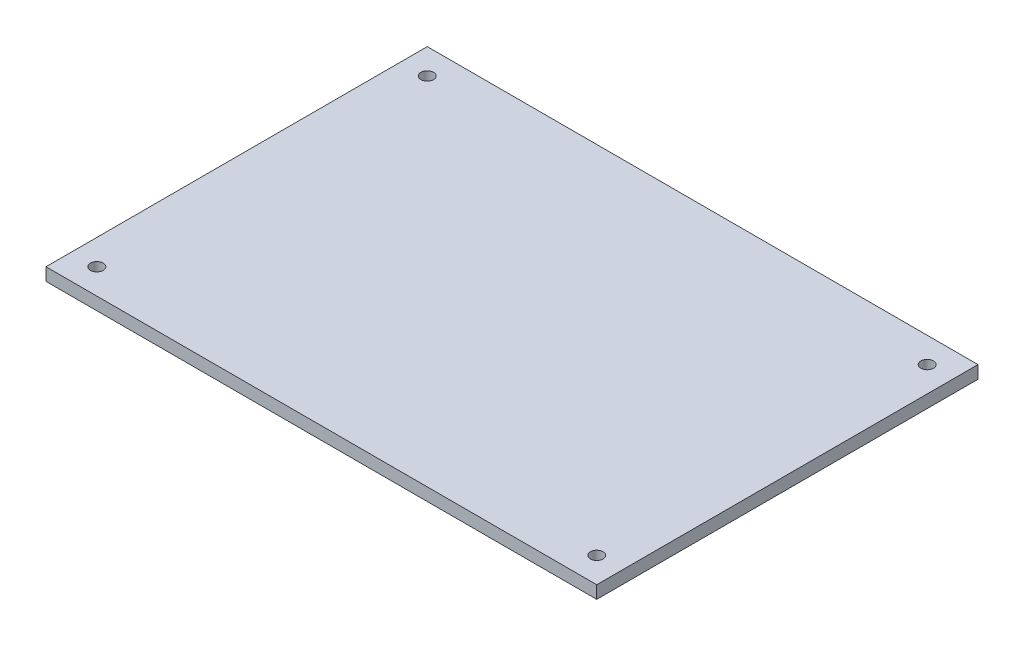
ISO-10303-21;
HEADER;
FILE_DESCRIPTION(('STEP AP214'),'2;1');
FILE_NAME('part.step','',(''),(''),'','','');
FILE_SCHEMA(('AUTOMOTIVE_DESIGN { 1 0 10303 214 1 1 1 1 }'));
ENDSEC;
DATA;
#1=APPLICATION_CONTEXT('core data for automotive mechanical design processes');
#2=APPLICATION_PROTOCOL_DEFINITION('international standard','automotive_design',2000,#1);
#3=PRODUCT_CONTEXT('',#1,'mechanical');
#4=PRODUCT('Part','Part','',(#3));
#5=PRODUCT_RELATED_PRODUCT_CATEGORY('part','',(#4));
#6=PRODUCT_DEFINITION_FORMATION('','',#4);
#7=PRODUCT_DEFINITION_CONTEXT('part definition',#1,'design');
#8=PRODUCT_DEFINITION('design','',#6,#7);
#9=PRODUCT_DEFINITION_SHAPE('','',#8);
#10=(LENGTH_UNIT() NAMED_UNIT(*) SI_UNIT(.MILLI.,.METRE.));
#11=(NAMED_UNIT(*) PLANE_ANGLE_UNIT() SI_UNIT($,.RADIAN.));
#12=(NAMED_UNIT(*) SI_UNIT($,.STERADIAN.) SOLID_ANGLE_UNIT());
#13=UNCERTAINTY_MEASURE_WITH_UNIT(LENGTH_MEASURE(1.E-05),#10,'distance_accuracy_value','');
#14=(GEOMETRIC_REPRESENTATION_CONTEXT(3) GLOBAL_UNCERTAINTY_ASSIGNED_CONTEXT((#13)) GLOBAL_UNIT_ASSIGNED_CONTEXT((#10,
#11,#12)) REPRESENTATION_CONTEXT('',''));
#15=CARTESIAN_POINT('',(0.,0.,0.));
#16=DIRECTION('',(0.,0.,1.));
#17=DIRECTION('',(1.,0.,0.));
#18=AXIS2_PLACEMENT_3D('',#15,#16,#17);
#19=CARTESIAN_POINT('',(-59.,0.,-39.));
#20=DIRECTION('',(0.,1.,0.));
#21=DIRECTION('',(0.,0.,1.));
#22=AXIS2_PLACEMENT_3D('',#19,#20,#21);
#23=CYLINDRICAL_SURFACE('',#22,1.5);
#24=CARTESIAN_POINT('',(-59.,0.,-39.));
#25=DIRECTION('',(0.,1.,0.));
#26=DIRECTION('',(0.,0.,1.));
#27=AXIS2_PLACEMENT_3D('',#24,#25,#26);
#28=CIRCLE('',#27,1.5);
#29=CARTESIAN_POINT('',(-59.,0.,-37.5));
#30=VERTEX_POINT('',#29);
#31=EDGE_CURVE('E40',#30,#30,#28,.T.);
#32=ORIENTED_EDGE('',*,*,#31,.F.);
#33=EDGE_LOOP('',(#32));
#34=FACE_BOUND('',#33,.T.);
#35=CARTESIAN_POINT('',(-59.,3.,-39.));
#36=DIRECTION('',(0.,1.,0.));
#37=DIRECTION('',(0.,0.,1.));
#38=AXIS2_PLACEMENT_3D('',#35,#36,#37);
#39=CIRCLE('',#38,1.5);
#40=CARTESIAN_POINT('',(-59.,3.,-37.5));
#41=VERTEX_POINT('',#40);
#42=EDGE_CURVE('E11',#41,#41,#39,.T.);
#43=ORIENTED_EDGE('',*,*,#42,.T.);
#44=EDGE_LOOP('',(#43));
#45=FACE_BOUND('',#44,.T.);
#46=ADVANCED_FACE('F32',(#34,#45),#23,.F.);
#47=CARTESIAN_POINT('',(-59.,0.,39.));
#48=DIRECTION('',(0.,1.,0.));
#49=DIRECTION('',(0.,0.,1.));
#50=AXIS2_PLACEMENT_3D('',#47,#48,#49);
#51=CYLINDRICAL_SURFACE('',#50,1.5);
#52=CARTESIAN_POINT('',(-59.,0.,39.));
#53=DIRECTION('',(0.,1.,0.));
#54=DIRECTION('',(0.,0.,1.));
#55=AXIS2_PLACEMENT_3D('',#52,#53,#54);
#56=CIRCLE('',#55,1.5);
#57=CARTESIAN_POINT('',(-59.,0.,40.5));
#58=VERTEX_POINT('',#57);
#59=EDGE_CURVE('E110',#58,#58,#56,.T.);
#60=ORIENTED_EDGE('',*,*,#59,.F.);
#61=EDGE_LOOP('',(#60));
#62=FACE_BOUND('',#61,.T.);
#63=CARTESIAN_POINT('',(-59.,3.,39.));
#64=DIRECTION('',(0.,1.,0.));
#65=DIRECTION('',(0.,0.,1.));
#66=AXIS2_PLACEMENT_3D('',#63,#64,#65);
#67=CIRCLE('',#66,1.5);
#68=CARTESIAN_POINT('',(-59.,3.,40.5));
#69=VERTEX_POINT('',#68);
#70=EDGE_CURVE('E113',#69,#69,#67,.T.);
#71=ORIENTED_EDGE('',*,*,#70,.T.);
#72=EDGE_LOOP('',(#71));
#73=FACE_BOUND('',#72,.T.);
#74=ADVANCED_FACE('F122',(#62,#73),#51,.F.);
#75=CARTESIAN_POINT('',(-65.,3.,45.));
#76=DIRECTION('',(1.,0.,0.));
#77=DIRECTION('',(0.,0.,-1.));
#78=AXIS2_PLACEMENT_3D('',#75,#76,#77);
#79=PLANE('',#78);
#80=DIRECTION('',(0.,0.,1.));
#81=VECTOR('',#80,1.);
#82=CARTESIAN_POINT('',(-65.,0.,45.));
#83=LINE('',#82,#81);
#84=CARTESIAN_POINT('',(-65.,0.,-45.));
#85=VERTEX_POINT('',#84);
#86=CARTESIAN_POINT('',(-65.,0.,45.));
#87=VERTEX_POINT('',#86);
#88=EDGE_CURVE('E100',#85,#87,#83,.T.);
#89=ORIENTED_EDGE('',*,*,#88,.T.);
#90=DIRECTION('',(0.,-1.,0.));
#91=VECTOR('',#90,1.);
#92=CARTESIAN_POINT('',(-65.,3.,45.));
#93=LINE('',#92,#91);
#94=CARTESIAN_POINT('',(-65.,3.,45.));
#95=VERTEX_POINT('',#94);
#96=EDGE_CURVE('E91',#95,#87,#93,.T.);
#97=ORIENTED_EDGE('',*,*,#96,.F.);
#98=DIRECTION('',(0.,0.,1.));
#99=VECTOR('',#98,1.);
#100=CARTESIAN_POINT('',(-65.,3.,45.));
#101=LINE('',#100,#99);
#102=CARTESIAN_POINT('',(-65.,3.,-45.));
#103=VERTEX_POINT('',#102);
#104=EDGE_CURVE('E85',#103,#95,#101,.T.);
#105=ORIENTED_EDGE('',*,*,#104,.F.);
#106=DIRECTION('',(0.,-1.,0.));
#107=VECTOR('',#106,1.);
#108=CARTESIAN_POINT('',(-65.,3.,-45.));
#109=LINE('',#108,#107);
#110=EDGE_CURVE('E96',#103,#85,#109,.T.);
#111=ORIENTED_EDGE('',*,*,#110,.T.);
#112=EDGE_LOOP('',(#89,#97,#105,#111));
#113=FACE_BOUND('',#112,.T.);
#114=ADVANCED_FACE('F146',(#113),#79,.F.);
#115=CARTESIAN_POINT('',(65.,3.,45.));
#116=DIRECTION('',(0.,0.,-1.));
#117=DIRECTION('',(-1.,0.,0.));
#118=AXIS2_PLACEMENT_3D('',#115,#116,#117);
#119=PLANE('',#118);
#120=DIRECTION('',(1.,0.,0.));
#121=VECTOR('',#120,1.);
#122=CARTESIAN_POINT('',(65.,0.,45.));
#123=LINE('',#122,#121);
#124=CARTESIAN_POINT('',(65.,0.,45.));
#125=VERTEX_POINT('',#124);
#126=EDGE_CURVE('E90',#87,#125,#123,.T.);
#127=ORIENTED_EDGE('',*,*,#126,.T.);
#128=DIRECTION('',(0.,-1.,0.));
#129=VECTOR('',#128,1.);
#130=CARTESIAN_POINT('',(65.,3.,45.));
#131=LINE('',#130,#129);
#132=CARTESIAN_POINT('',(65.,3.,45.));
#133=VERTEX_POINT('',#132);
#134=EDGE_CURVE('E88',#133,#125,#131,.T.);
#135=ORIENTED_EDGE('',*,*,#134,.F.);
#136=DIRECTION('',(1.,0.,0.));
#137=VECTOR('',#136,1.);
#138=CARTESIAN_POINT('',(65.,3.,45.));
#139=LINE('',#138,#137);
#140=EDGE_CURVE('E79',#95,#133,#139,.T.);
#141=ORIENTED_EDGE('',*,*,#140,.F.);
#142=ORIENTED_EDGE('',*,*,#96,.T.);
#143=EDGE_LOOP('',(#127,#135,#141,#142));
#144=FACE_BOUND('',#143,.T.);
#145=ADVANCED_FACE('F89',(#144),#119,.F.);
#146=CARTESIAN_POINT('',(65.,3.,45.));
#147=DIRECTION('',(-1.,0.,0.));
#148=DIRECTION('',(0.,0.,1.));
#149=AXIS2_PLACEMENT_3D('',#146,#147,#148);
#150=PLANE('',#149);
#151=DIRECTION('',(0.,0.,-1.));
#152=VECTOR('',#151,1.);
#153=CARTESIAN_POINT('',(65.,0.,45.));
#154=LINE('',#153,#152);
#155=CARTESIAN_POINT('',(65.,0.,-45.));
#156=VERTEX_POINT('',#155);
#157=EDGE_CURVE('E65',#125,#156,#154,.T.);
#158=ORIENTED_EDGE('',*,*,#157,.T.);
#159=DIRECTION('',(0.,-1.,0.));
#160=VECTOR('',#159,1.);
#161=CARTESIAN_POINT('',(65.,3.,-45.));
#162=LINE('',#161,#160);
#163=CARTESIAN_POINT('',(65.,3.,-45.));
#164=VERTEX_POINT('',#163);
#165=EDGE_CURVE('E92',#164,#156,#162,.T.);
#166=ORIENTED_EDGE('',*,*,#165,.F.);
#167=DIRECTION('',(0.,0.,-1.));
#168=VECTOR('',#167,1.);
#169=CARTESIAN_POINT('',(65.,3.,45.));
#170=LINE('',#169,#168);
#171=EDGE_CURVE('E83',#133,#164,#170,.T.);
#172=ORIENTED_EDGE('',*,*,#171,.F.);
#173=ORIENTED_EDGE('',*,*,#134,.T.);
#174=EDGE_LOOP('',(#158,#166,#172,#173));
#175=FACE_BOUND('',#174,.T.);
#176=ADVANCED_FACE('F94',(#175),#150,.F.);
#177=CARTESIAN_POINT('',(65.,3.,-45.));
#178=DIRECTION('',(0.,0.,1.));
#179=DIRECTION('',(1.,0.,0.));
#180=AXIS2_PLACEMENT_3D('',#177,#178,#179);
#181=PLANE('',#180);
#182=DIRECTION('',(-1.,0.,0.));
#183=VECTOR('',#182,1.);
#184=CARTESIAN_POINT('',(65.,0.,-45.));
#185=LINE('',#184,#183);
#186=EDGE_CURVE('E71',#156,#85,#185,.T.);
#187=ORIENTED_EDGE('',*,*,#186,.T.);
#188=ORIENTED_EDGE('',*,*,#110,.F.);
#189=DIRECTION('',(-1.,0.,0.));
#190=VECTOR('',#189,1.);
#191=CARTESIAN_POINT('',(65.,3.,-45.));
#192=LINE('',#191,#190);
#193=EDGE_CURVE('E48',#164,#103,#192,.T.);
#194=ORIENTED_EDGE('',*,*,#193,.F.);
#195=ORIENTED_EDGE('',*,*,#165,.T.);
#196=EDGE_LOOP('',(#187,#188,#194,#195));
#197=FACE_BOUND('',#196,.T.);
#198=ADVANCED_FACE('F126',(#197),#181,.F.);
#199=CARTESIAN_POINT('',(0.,3.,0.));
#200=DIRECTION('',(0.,1.,0.));
#201=DIRECTION('',(0.,0.,1.));
#202=AXIS2_PLACEMENT_3D('',#199,#200,#201);
#203=PLANE('',#202);
#204=CARTESIAN_POINT('',(59.,3.,-39.));
#205=DIRECTION('',(0.,1.,0.));
#206=DIRECTION('',(0.,0.,1.));
#207=AXIS2_PLACEMENT_3D('',#204,#205,#206);
#208=CIRCLE('',#207,1.5);
#209=CARTESIAN_POINT('',(59.,3.,-37.5));
#210=VERTEX_POINT('',#209);
#211=EDGE_CURVE('E217',#210,#210,#208,.T.);
#212=ORIENTED_EDGE('',*,*,#211,.F.);
#213=EDGE_LOOP('',(#212));
#214=FACE_BOUND('',#213,.T.);
#215=CARTESIAN_POINT('',(59.,3.,39.));
#216=DIRECTION('',(0.,1.,0.));
#217=DIRECTION('',(0.,0.,1.));
#218=AXIS2_PLACEMENT_3D('',#215,#216,#217);
#219=CIRCLE('',#218,1.5);
#220=CARTESIAN_POINT('',(59.,3.,40.5));
#221=VERTEX_POINT('',#220);
#222=EDGE_CURVE('E218',#221,#221,#219,.T.);
#223=ORIENTED_EDGE('',*,*,#222,.F.);
#224=EDGE_LOOP('',(#223));
#225=FACE_BOUND('',#224,.T.);
#226=ORIENTED_EDGE('',*,*,#104,.T.);
#227=ORIENTED_EDGE('',*,*,#140,.T.);
#228=ORIENTED_EDGE('',*,*,#171,.T.);
#229=ORIENTED_EDGE('',*,*,#193,.T.);
#230=EDGE_LOOP('',(#226,#227,#228,#229));
#231=FACE_BOUND('',#230,.T.);
#232=ORIENTED_EDGE('',*,*,#70,.F.);
#233=EDGE_LOOP('',(#232));
#234=FACE_BOUND('',#233,.T.);
#235=ORIENTED_EDGE('',*,*,#42,.F.);
#236=EDGE_LOOP('',(#235));
#237=FACE_BOUND('',#236,.T.);
#238=ADVANCED_FACE('F80',(#214,#225,#231,#234,#237),#203,.T.);
#239=CARTESIAN_POINT('',(0.,0.,0.));
#240=DIRECTION('',(0.,1.,0.));
#241=DIRECTION('',(0.,0.,1.));
#242=AXIS2_PLACEMENT_3D('',#239,#240,#241);
#243=PLANE('',#242);
#244=CARTESIAN_POINT('',(59.,0.,-39.));
#245=DIRECTION('',(0.,1.,0.));
#246=DIRECTION('',(0.,0.,1.));
#247=AXIS2_PLACEMENT_3D('',#244,#245,#246);
#248=CIRCLE('',#247,1.5);
#249=CARTESIAN_POINT('',(59.,0.,-37.5));
#250=VERTEX_POINT('',#249);
#251=EDGE_CURVE('E215',#250,#250,#248,.T.);
#252=ORIENTED_EDGE('',*,*,#251,.T.);
#253=EDGE_LOOP('',(#252));
#254=FACE_BOUND('',#253,.T.);
#255=CARTESIAN_POINT('',(59.,0.,39.));
#256=DIRECTION('',(0.,1.,0.));
#257=DIRECTION('',(0.,0.,1.));
#258=AXIS2_PLACEMENT_3D('',#255,#256,#257);
#259=CIRCLE('',#258,1.5);
#260=CARTESIAN_POINT('',(59.,0.,40.5));
#261=VERTEX_POINT('',#260);
#262=EDGE_CURVE('E103',#261,#261,#259,.T.);
#263=ORIENTED_EDGE('',*,*,#262,.T.);
#264=EDGE_LOOP('',(#263));
#265=FACE_BOUND('',#264,.T.);
#266=ORIENTED_EDGE('',*,*,#88,.F.);
#267=ORIENTED_EDGE('',*,*,#186,.F.);
#268=ORIENTED_EDGE('',*,*,#157,.F.);
#269=ORIENTED_EDGE('',*,*,#126,.F.);
#270=EDGE_LOOP('',(#266,#267,#268,#269));
#271=FACE_BOUND('',#270,.T.);
#272=ORIENTED_EDGE('',*,*,#59,.T.);
#273=EDGE_LOOP('',(#272));
#274=FACE_BOUND('',#273,.T.);
#275=ORIENTED_EDGE('',*,*,#31,.T.);
#276=EDGE_LOOP('',(#275));
#277=FACE_BOUND('',#276,.T.);
#278=ADVANCED_FACE('F118',(#254,#265,#271,#274,#277),#243,.F.);
#279=CARTESIAN_POINT('',(59.,0.,39.));
#280=DIRECTION('',(0.,1.,0.));
#281=DIRECTION('',(0.,0.,1.));
#282=AXIS2_PLACEMENT_3D('',#279,#280,#281);
#283=CYLINDRICAL_SURFACE('',#282,1.5);
#284=ORIENTED_EDGE('',*,*,#262,.F.);
#285=EDGE_LOOP('',(#284));
#286=FACE_BOUND('',#285,.T.);
#287=ORIENTED_EDGE('',*,*,#222,.T.);
#288=EDGE_LOOP('',(#287));
#289=FACE_BOUND('',#288,.T.);
#290=ADVANCED_FACE('F133',(#286,#289),#283,.F.);
#291=CARTESIAN_POINT('',(59.,0.,-39.));
#292=DIRECTION('',(0.,1.,0.));
#293=DIRECTION('',(0.,0.,1.));
#294=AXIS2_PLACEMENT_3D('',#291,#292,#293);
#295=CYLINDRICAL_SURFACE('',#294,1.5);
#296=ORIENTED_EDGE('',*,*,#251,.F.);
#297=EDGE_LOOP('',(#296));
#298=FACE_BOUND('',#297,.T.);
#299=ORIENTED_EDGE('',*,*,#211,.T.);
#300=EDGE_LOOP('',(#299));
#301=FACE_BOUND('',#300,.T.);
#302=ADVANCED_FACE('F184',(#298,#301),#295,.F.);
#303=CLOSED_SHELL('',(#46,#74,#114,#145,#176,#198,#238,#278,#290,#302));
#304=MANIFOLD_SOLID_BREP('B2',#303);
#305=ADVANCED_BREP_SHAPE_REPRESENTATION('',(#18,#304),#14);
#306=SHAPE_DEFINITION_REPRESENTATION(#9,#305);
ENDSEC;
END-ISO-10303-21;
